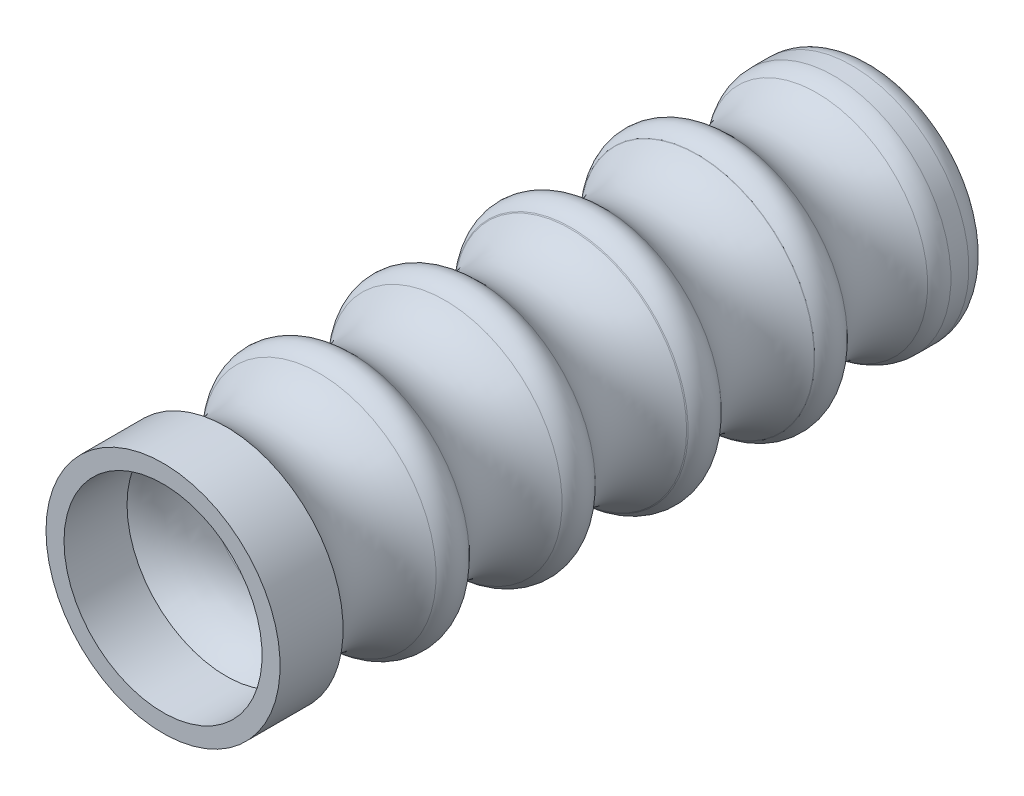
ISO-10303-21;
HEADER;
FILE_DESCRIPTION(('STEP AP214'),'2;1');
FILE_NAME('part.step','',(''),(''),'','','');
FILE_SCHEMA(('AUTOMOTIVE_DESIGN { 1 0 10303 214 1 1 1 1 }'));
ENDSEC;
DATA;
#1=APPLICATION_CONTEXT('core data for automotive mechanical design processes');
#2=APPLICATION_PROTOCOL_DEFINITION('international standard','automotive_design',2000,#1);
#3=PRODUCT_CONTEXT('',#1,'mechanical');
#4=PRODUCT('Part','Part','',(#3));
#5=PRODUCT_RELATED_PRODUCT_CATEGORY('part','',(#4));
#6=PRODUCT_DEFINITION_FORMATION('','',#4);
#7=PRODUCT_DEFINITION_CONTEXT('part definition',#1,'design');
#8=PRODUCT_DEFINITION('design','',#6,#7);
#9=PRODUCT_DEFINITION_SHAPE('','',#8);
#10=(LENGTH_UNIT() NAMED_UNIT(*) SI_UNIT(.MILLI.,.METRE.));
#11=(NAMED_UNIT(*) PLANE_ANGLE_UNIT() SI_UNIT($,.RADIAN.));
#12=(NAMED_UNIT(*) SI_UNIT($,.STERADIAN.) SOLID_ANGLE_UNIT());
#13=UNCERTAINTY_MEASURE_WITH_UNIT(LENGTH_MEASURE(1.E-05),#10,'distance_accuracy_value','');
#14=(GEOMETRIC_REPRESENTATION_CONTEXT(3) GLOBAL_UNCERTAINTY_ASSIGNED_CONTEXT((#13)) GLOBAL_UNIT_ASSIGNED_CONTEXT((#10,
#11,#12)) REPRESENTATION_CONTEXT('',''));
#15=CARTESIAN_POINT('',(0.,0.,0.));
#16=DIRECTION('',(0.,0.,1.));
#17=DIRECTION('',(1.,0.,0.));
#18=AXIS2_PLACEMENT_3D('',#15,#16,#17);
#19=CARTESIAN_POINT('',(-4.44387737948111,0.,-64.3386919312712));
#20=DIRECTION('',(0.,0.,-1.));
#21=DIRECTION('',(-1.,0.,0.));
#22=AXIS2_PLACEMENT_3D('',#19,#20,#21);
#23=TOROIDAL_SURFACE('',#22,10.5000023446732,2.5);
#24=CARTESIAN_POINT('',(-4.44387737948111,0.,-66.8386919312712));
#25=DIRECTION('',(0.,0.,-1.));
#26=DIRECTION('',(-1.,0.,0.));
#27=AXIS2_PLACEMENT_3D('',#24,#25,#26);
#28=CIRCLE('',#27,10.5000023446732);
#29=CARTESIAN_POINT('',(-14.9438797241543,0.,-66.8386919312712));
#30=VERTEX_POINT('',#29);
#31=EDGE_CURVE('E10',#30,#30,#28,.T.);
#32=ORIENTED_EDGE('',*,*,#31,.F.);
#33=EDGE_LOOP('',(#32));
#34=FACE_BOUND('',#33,.T.);
#35=CARTESIAN_POINT('',(-4.44387737948111,0.,-64.3386919312712));
#36=DIRECTION('',(0.,0.,-1.));
#37=DIRECTION('',(-1.,0.,0.));
#38=AXIS2_PLACEMENT_3D('',#35,#36,#37);
#39=CIRCLE('',#38,13.0000023446732);
#40=CARTESIAN_POINT('',(-17.4438797241543,0.,-64.3386919312712));
#41=VERTEX_POINT('',#40);
#42=EDGE_CURVE('E94',#41,#41,#39,.T.);
#43=ORIENTED_EDGE('',*,*,#42,.T.);
#44=EDGE_LOOP('',(#43));
#45=FACE_BOUND('',#44,.T.);
#46=ADVANCED_FACE('F30',(#34,#45),#23,.T.);
#47=CARTESIAN_POINT('',(6.05612496519209,0.,-66.8386919312712));
#48=DIRECTION('',(0.,0.,1.));
#49=DIRECTION('',(1.,0.,0.));
#50=AXIS2_PLACEMENT_3D('',#47,#48,#49);
#51=PLANE('',#50);
#52=CARTESIAN_POINT('',(-4.44387737948111,0.,-66.8386919312712));
#53=DIRECTION('',(0.,0.,-1.));
#54=DIRECTION('',(-1.,0.,0.));
#55=AXIS2_PLACEMENT_3D('',#52,#53,#54);
#56=CIRCLE('',#55,9.06762904577595);
#57=CARTESIAN_POINT('',(-13.5115064252571,0.,-66.8386919312712));
#58=VERTEX_POINT('',#57);
#59=EDGE_CURVE('E36',#58,#58,#56,.T.);
#60=ORIENTED_EDGE('',*,*,#59,.F.);
#61=EDGE_LOOP('',(#60));
#62=FACE_BOUND('',#61,.T.);
#63=ORIENTED_EDGE('',*,*,#31,.T.);
#64=EDGE_LOOP('',(#63));
#65=FACE_BOUND('',#64,.T.);
#66=ADVANCED_FACE('F113',(#62,#65),#51,.F.);
#67=CARTESIAN_POINT('',(-4.44387737948111,0.,-38.83686860797));
#68=DIRECTION('',(0.,0.,-1.));
#69=DIRECTION('',(-1.,0.,0.));
#70=AXIS2_PLACEMENT_3D('',#67,#68,#69);
#71=CYLINDRICAL_SURFACE('',#70,9.06762904577594);
#72=ORIENTED_EDGE('',*,*,#59,.T.);
#73=EDGE_LOOP('',(#72));
#74=FACE_BOUND('',#73,.T.);
#75=CARTESIAN_POINT('',(-4.4438773794811,0.,-1.83869193127119));
#76=DIRECTION('',(0.,0.,-1.));
#77=DIRECTION('',(-1.,0.,0.));
#78=AXIS2_PLACEMENT_3D('',#75,#76,#77);
#79=CIRCLE('',#78,9.06762904577594);
#80=CARTESIAN_POINT('',(-13.511506425257,0.,-1.83869193127119));
#81=VERTEX_POINT('',#80);
#82=EDGE_CURVE('E40',#81,#81,#79,.T.);
#83=ORIENTED_EDGE('',*,*,#82,.F.);
#84=EDGE_LOOP('',(#83));
#85=FACE_BOUND('',#84,.T.);
#86=ADVANCED_FACE('F109',(#74,#85),#71,.F.);
#87=CARTESIAN_POINT('',(6.5561226205189,0.,5.16130806872881));
#88=CARTESIAN_POINT('',(3.76001048112798,0.,2.13786769770095));
#89=CARTESIAN_POINT('',(4.62375166629483,0.,-1.83869193127119));
#90=B_SPLINE_CURVE_WITH_KNOTS('',2,(#87,#88,#89),.UNSPECIFIED.,.F.,.F.,(3,3),(0.,1.),.UNSPECIFIED.);
#91=CARTESIAN_POINT('',(-4.44387737948111,0.,-38.83686860797));
#92=DIRECTION('',(0.,0.,-1.));
#93=AXIS1_PLACEMENT('',#91,#92);
#94=SURFACE_OF_REVOLUTION('',#90,#93);
#95=ORIENTED_EDGE('',*,*,#82,.T.);
#96=EDGE_LOOP('',(#95));
#97=FACE_BOUND('',#96,.T.);
#98=CARTESIAN_POINT('',(-4.4438773794811,0.,5.1613080687288));
#99=DIRECTION('',(0.,0.,-1.));
#100=DIRECTION('',(-1.,0.,0.));
#101=AXIS2_PLACEMENT_3D('',#98,#99,#100);
#102=CIRCLE('',#101,11.);
#103=CARTESIAN_POINT('',(-15.4438773794811,0.,5.1613080687288));
#104=VERTEX_POINT('',#103);
#105=EDGE_CURVE('E44',#104,#104,#102,.T.);
#106=ORIENTED_EDGE('',*,*,#105,.F.);
#107=EDGE_LOOP('',(#106));
#108=FACE_BOUND('',#107,.T.);
#109=ADVANCED_FACE('F104',(#97,#108),#94,.F.);
#110=CARTESIAN_POINT('',(-4.44387737948111,0.,-38.83686860797));
#111=DIRECTION('',(0.,0.,-1.));
#112=DIRECTION('',(-1.,0.,0.));
#113=AXIS2_PLACEMENT_3D('',#110,#111,#112);
#114=CYLINDRICAL_SURFACE('',#113,11.);
#115=ORIENTED_EDGE('',*,*,#105,.T.);
#116=EDGE_LOOP('',(#115));
#117=FACE_BOUND('',#116,.T.);
#118=CARTESIAN_POINT('',(-4.4438773794811,0.,12.1613080687288));
#119=DIRECTION('',(0.,0.,-1.));
#120=DIRECTION('',(-1.,0.,0.));
#121=AXIS2_PLACEMENT_3D('',#118,#119,#120);
#122=CIRCLE('',#121,11.);
#123=CARTESIAN_POINT('',(-15.4438773794811,0.,12.1613080687288));
#124=VERTEX_POINT('',#123);
#125=EDGE_CURVE('E49',#124,#124,#122,.T.);
#126=ORIENTED_EDGE('',*,*,#125,.F.);
#127=EDGE_LOOP('',(#126));
#128=FACE_BOUND('',#127,.T.);
#129=ADVANCED_FACE('F108',(#117,#128),#114,.F.);
#130=CARTESIAN_POINT('',(8.5561226205189,0.,12.1613080687288));
#131=DIRECTION('',(0.,0.,1.));
#132=DIRECTION('',(1.,0.,0.));
#133=AXIS2_PLACEMENT_3D('',#130,#131,#132);
#134=PLANE('',#133);
#135=ORIENTED_EDGE('',*,*,#125,.T.);
#136=EDGE_LOOP('',(#135));
#137=FACE_BOUND('',#136,.T.);
#138=CARTESIAN_POINT('',(-4.4438773794811,0.,12.1613080687288));
#139=DIRECTION('',(0.,0.,-1.));
#140=DIRECTION('',(-1.,0.,0.));
#141=AXIS2_PLACEMENT_3D('',#138,#139,#140);
#142=CIRCLE('',#141,13.);
#143=CARTESIAN_POINT('',(-17.4438773794811,0.,12.1613080687288));
#144=VERTEX_POINT('',#143);
#145=EDGE_CURVE('E52',#144,#144,#142,.T.);
#146=ORIENTED_EDGE('',*,*,#145,.F.);
#147=EDGE_LOOP('',(#146));
#148=FACE_BOUND('',#147,.T.);
#149=ADVANCED_FACE('F182',(#137,#148),#134,.T.);
#150=CARTESIAN_POINT('',(-4.44387737948111,0.,-38.83686860797));
#151=DIRECTION('',(0.,0.,-1.));
#152=DIRECTION('',(-1.,0.,0.));
#153=AXIS2_PLACEMENT_3D('',#150,#151,#152);
#154=CYLINDRICAL_SURFACE('',#153,13.);
#155=ORIENTED_EDGE('',*,*,#145,.T.);
#156=EDGE_LOOP('',(#155));
#157=FACE_BOUND('',#156,.T.);
#158=CARTESIAN_POINT('',(-4.4438773794811,0.,5.1613080687288));
#159=DIRECTION('',(0.,0.,-1.));
#160=DIRECTION('',(-1.,0.,0.));
#161=AXIS2_PLACEMENT_3D('',#158,#159,#160);
#162=CIRCLE('',#161,13.);
#163=CARTESIAN_POINT('',(-17.4438773794811,0.,5.16130806872881));
#164=VERTEX_POINT('',#163);
#165=EDGE_CURVE('E55',#164,#164,#162,.T.);
#166=ORIENTED_EDGE('',*,*,#165,.F.);
#167=EDGE_LOOP('',(#166));
#168=FACE_BOUND('',#167,.T.);
#169=ADVANCED_FACE('F179',(#157,#168),#154,.T.);
#170=CARTESIAN_POINT('',(-4.4438773794811,0.,0.));
#171=DIRECTION('',(0.,0.,-1.));
#172=DIRECTION('',(-1.,0.,0.));
#173=AXIS2_PLACEMENT_3D('',#170,#171,#172);
#174=TOROIDAL_SURFACE('',#173,17.7287312272556,6.99999999999621);
#175=ORIENTED_EDGE('',*,*,#165,.T.);
#176=EDGE_LOOP('',(#175));
#177=FACE_BOUND('',#176,.T.);
#178=CARTESIAN_POINT('',(-4.4438773794811,0.,-5.1613080687288));
#179=DIRECTION('',(0.,0.,-1.));
#180=DIRECTION('',(-1.,0.,0.));
#181=AXIS2_PLACEMENT_3D('',#178,#179,#180);
#182=CIRCLE('',#181,13.);
#183=CARTESIAN_POINT('',(-17.4438773794811,0.,-5.1613080687288));
#184=VERTEX_POINT('',#183);
#185=EDGE_CURVE('E58',#184,#184,#182,.T.);
#186=ORIENTED_EDGE('',*,*,#185,.F.);
#187=EDGE_LOOP('',(#186));
#188=FACE_BOUND('',#187,.T.);
#189=ADVANCED_FACE('F175',(#177,#188),#174,.F.);
#190=CARTESIAN_POINT('',(-4.44387737948111,0.,-7.00463237899009));
#191=DIRECTION('',(0.,0.,-1.));
#192=DIRECTION('',(-1.,0.,0.));
#193=AXIS2_PLACEMENT_3D('',#190,#191,#192);
#194=TOROIDAL_SURFACE('',#193,11.3111674188364,2.5);
#195=CARTESIAN_POINT('',(-4.4438773794811,0.,-8.84551814143882));
#196=DIRECTION('',(0.,0.,-1.));
#197=DIRECTION('',(-1.,0.,0.));
#198=AXIS2_PLACEMENT_3D('',#195,#196,#197);
#199=CIRCLE('',#198,13.0026577704534);
#200=CARTESIAN_POINT('',(-17.4465351499346,0.,-8.84551814143881));
#201=VERTEX_POINT('',#200);
#202=EDGE_CURVE('E61',#201,#201,#199,.T.);
#203=ORIENTED_EDGE('',*,*,#202,.F.);
#204=EDGE_LOOP('',(#203));
#205=FACE_BOUND('',#204,.T.);
#206=ORIENTED_EDGE('',*,*,#185,.T.);
#207=EDGE_LOOP('',(#206));
#208=FACE_BOUND('',#207,.T.);
#209=ADVANCED_FACE('F171',(#205,#208),#194,.T.);
#210=CARTESIAN_POINT('',(-4.4438773794811,0.,-14.0000036464255));
#211=DIRECTION('',(0.,0.,-1.));
#212=DIRECTION('',(-1.,0.,0.));
#213=AXIS2_PLACEMENT_3D('',#210,#211,#212);
#214=TOROIDAL_SURFACE('',#213,17.7388356893034,7.00000729286192);
#215=ORIENTED_EDGE('',*,*,#202,.T.);
#216=EDGE_LOOP('',(#215));
#217=FACE_BOUND('',#216,.T.);
#218=CARTESIAN_POINT('',(-4.44387737948111,0.,-19.1544901126445));
#219=DIRECTION('',(0.,0.,-1.));
#220=DIRECTION('',(-1.,0.,0.));
#221=AXIS2_PLACEMENT_3D('',#218,#219,#220);
#222=CIRCLE('',#221,13.0026588165837);
#223=CARTESIAN_POINT('',(-17.4465361960648,0.,-19.1544901126445));
#224=VERTEX_POINT('',#223);
#225=EDGE_CURVE('E64',#224,#224,#222,.T.);
#226=ORIENTED_EDGE('',*,*,#225,.F.);
#227=EDGE_LOOP('',(#226));
#228=FACE_BOUND('',#227,.T.);
#229=ADVANCED_FACE('F167',(#217,#228),#214,.F.);
#230=CARTESIAN_POINT('',(-4.44387737948111,0.,-20.9953762183901));
#231=DIRECTION('',(0.,0.,-1.));
#232=DIRECTION('',(-1.,0.,0.));
#233=AXIS2_PLACEMENT_3D('',#230,#231,#232);
#234=TOROIDAL_SURFACE('',#233,11.3111688385842,2.5);
#235=CARTESIAN_POINT('',(-4.44387737948111,0.,-22.8386996812448));
#236=DIRECTION('',(0.,0.,-1.));
#237=DIRECTION('',(-1.,0.,0.));
#238=AXIS2_PLACEMENT_3D('',#235,#236,#237);
#239=CIRCLE('',#238,13.0000023446733);
#240=CARTESIAN_POINT('',(-17.4438797241544,0.,-22.8386996812448));
#241=VERTEX_POINT('',#240);
#242=EDGE_CURVE('E67',#241,#241,#239,.T.);
#243=ORIENTED_EDGE('',*,*,#242,.F.);
#244=EDGE_LOOP('',(#243));
#245=FACE_BOUND('',#244,.T.);
#246=ORIENTED_EDGE('',*,*,#225,.T.);
#247=EDGE_LOOP('',(#246));
#248=FACE_BOUND('',#247,.T.);
#249=ADVANCED_FACE('F163',(#245,#248),#234,.T.);
#250=CARTESIAN_POINT('',(-4.44387737948111,0.,-27.9999999999967));
#251=DIRECTION('',(0.,0.,-1.));
#252=DIRECTION('',(-1.,0.,0.));
#253=AXIS2_PLACEMENT_3D('',#250,#251,#252);
#254=TOROIDAL_SURFACE('',#253,17.7287312351509,6.99999270713808);
#255=ORIENTED_EDGE('',*,*,#242,.T.);
#256=EDGE_LOOP('',(#255));
#257=FACE_BOUND('',#256,.T.);
#258=CARTESIAN_POINT('',(-4.44387737948111,0.,-33.078995813976));
#259=DIRECTION('',(0.,0.,-1.));
#260=DIRECTION('',(-1.,0.,0.));
#261=AXIS2_PLACEMENT_3D('',#258,#259,#260);
#262=CIRCLE('',#261,12.9117093936428);
#263=CARTESIAN_POINT('',(-17.3555867731239,0.,-33.078995813976));
#264=VERTEX_POINT('',#263);
#265=EDGE_CURVE('E70',#264,#264,#262,.T.);
#266=ORIENTED_EDGE('',*,*,#265,.F.);
#267=EDGE_LOOP('',(#266));
#268=FACE_BOUND('',#267,.T.);
#269=ADVANCED_FACE('F159',(#257,#268),#254,.F.);
#270=CARTESIAN_POINT('',(-4.44387737948111,0.,-33.1544901126445));
#271=DIRECTION('',(0.,0.,-1.));
#272=DIRECTION('',(-1.,0.,0.));
#273=AXIS2_PLACEMENT_3D('',#270,#271,#272);
#274=CONICAL_SURFACE('',#273,13.0026588165836,0.877987624005164);
#275=ORIENTED_EDGE('',*,*,#265,.T.);
#276=EDGE_LOOP('',(#275));
#277=FACE_BOUND('',#276,.T.);
#278=CARTESIAN_POINT('',(-4.44387737948111,0.,-33.1544901126445));
#279=DIRECTION('',(0.,0.,-1.));
#280=DIRECTION('',(-1.,0.,0.));
#281=AXIS2_PLACEMENT_3D('',#278,#279,#280);
#282=CIRCLE('',#281,13.0026588165836);
#283=CARTESIAN_POINT('',(-17.4465361960647,0.,-33.1544901126445));
#284=VERTEX_POINT('',#283);
#285=EDGE_CURVE('E73',#284,#284,#282,.T.);
#286=ORIENTED_EDGE('',*,*,#285,.F.);
#287=EDGE_LOOP('',(#286));
#288=FACE_BOUND('',#287,.T.);
#289=ADVANCED_FACE('F155',(#277,#288),#274,.T.);
#290=CARTESIAN_POINT('',(-4.44387737948111,0.,-34.9953762183901));
#291=DIRECTION('',(0.,0.,-1.));
#292=DIRECTION('',(-1.,0.,0.));
#293=AXIS2_PLACEMENT_3D('',#290,#291,#292);
#294=TOROIDAL_SURFACE('',#293,11.3111688385841,2.5);
#295=CARTESIAN_POINT('',(-4.44387737948111,0.,-36.8386996812448));
#296=DIRECTION('',(0.,0.,-1.));
#297=DIRECTION('',(-1.,0.,0.));
#298=AXIS2_PLACEMENT_3D('',#295,#296,#297);
#299=CIRCLE('',#298,13.0000023446732);
#300=CARTESIAN_POINT('',(-17.4438797241543,0.,-36.8386996812448));
#301=VERTEX_POINT('',#300);
#302=EDGE_CURVE('E76',#301,#301,#299,.T.);
#303=ORIENTED_EDGE('',*,*,#302,.F.);
#304=EDGE_LOOP('',(#303));
#305=FACE_BOUND('',#304,.T.);
#306=ORIENTED_EDGE('',*,*,#285,.T.);
#307=EDGE_LOOP('',(#306));
#308=FACE_BOUND('',#307,.T.);
#309=ADVANCED_FACE('F151',(#305,#308),#294,.T.);
#310=CARTESIAN_POINT('',(-4.44387737948111,0.,-41.9999999999967));
#311=DIRECTION('',(0.,0.,-1.));
#312=DIRECTION('',(-1.,0.,0.));
#313=AXIS2_PLACEMENT_3D('',#310,#311,#312);
#314=TOROIDAL_SURFACE('',#313,17.7287312351509,6.99999270713808);
#315=ORIENTED_EDGE('',*,*,#302,.T.);
#316=EDGE_LOOP('',(#315));
#317=FACE_BOUND('',#316,.T.);
#318=CARTESIAN_POINT('',(-4.44387737948111,0.,-47.1613003187486));
#319=DIRECTION('',(0.,0.,-1.));
#320=DIRECTION('',(-1.,0.,0.));
#321=AXIS2_PLACEMENT_3D('',#318,#319,#320);
#322=CIRCLE('',#321,13.0000023446732);
#323=CARTESIAN_POINT('',(-17.4438797241543,0.,-47.1613003187486));
#324=VERTEX_POINT('',#323);
#325=EDGE_CURVE('E79',#324,#324,#322,.T.);
#326=ORIENTED_EDGE('',*,*,#325,.F.);
#327=EDGE_LOOP('',(#326));
#328=FACE_BOUND('',#327,.T.);
#329=ADVANCED_FACE('F147',(#317,#328),#314,.F.);
#330=CARTESIAN_POINT('',(-4.44387737948111,0.,-47.1613003187486));
#331=DIRECTION('',(0.,0.,-1.));
#332=DIRECTION('',(-1.,0.,0.));
#333=AXIS2_PLACEMENT_3D('',#330,#331,#332);
#334=CONICAL_SURFACE('',#333,13.0000023446732,0.998560911686196);
#335=CARTESIAN_POINT('',(-4.44387737948111,0.,-47.1819595420842));
#336=DIRECTION('',(0.,0.,-1.));
#337=DIRECTION('',(-1.,0.,0.));
#338=AXIS2_PLACEMENT_3D('',#335,#336,#337);
#339=CIRCLE('',#338,13.0320755641493);
#340=CARTESIAN_POINT('',(-17.4759529436304,0.,-47.1819595420842));
#341=VERTEX_POINT('',#340);
#342=EDGE_CURVE('E82',#341,#341,#339,.T.);
#343=ORIENTED_EDGE('',*,*,#342,.F.);
#344=EDGE_LOOP('',(#343));
#345=FACE_BOUND('',#344,.T.);
#346=ORIENTED_EDGE('',*,*,#325,.T.);
#347=EDGE_LOOP('',(#346));
#348=FACE_BOUND('',#347,.T.);
#349=ADVANCED_FACE('F143',(#345,#348),#334,.T.);
#350=CARTESIAN_POINT('',(-4.44387737948111,0.,-48.9953762183901));
#351=DIRECTION('',(0.,0.,-1.));
#352=DIRECTION('',(-1.,0.,0.));
#353=AXIS2_PLACEMENT_3D('',#350,#351,#352);
#354=TOROIDAL_SURFACE('',#353,11.3111688385841,2.5);
#355=CARTESIAN_POINT('',(-4.44387737948111,0.,-50.8386996812448));
#356=DIRECTION('',(0.,0.,-1.));
#357=DIRECTION('',(-1.,0.,0.));
#358=AXIS2_PLACEMENT_3D('',#355,#356,#357);
#359=CIRCLE('',#358,13.0000023446732);
#360=CARTESIAN_POINT('',(-17.4438797241543,0.,-50.8386996812448));
#361=VERTEX_POINT('',#360);
#362=EDGE_CURVE('E85',#361,#361,#359,.T.);
#363=ORIENTED_EDGE('',*,*,#362,.F.);
#364=EDGE_LOOP('',(#363));
#365=FACE_BOUND('',#364,.T.);
#366=ORIENTED_EDGE('',*,*,#342,.T.);
#367=EDGE_LOOP('',(#366));
#368=FACE_BOUND('',#367,.T.);
#369=ADVANCED_FACE('F139',(#365,#368),#354,.T.);
#370=CARTESIAN_POINT('',(-4.44387737948111,0.,-55.9999999999967));
#371=DIRECTION('',(0.,0.,-1.));
#372=DIRECTION('',(-1.,0.,0.));
#373=AXIS2_PLACEMENT_3D('',#370,#371,#372);
#374=TOROIDAL_SURFACE('',#373,17.7287312351508,6.99999270713808);
#375=ORIENTED_EDGE('',*,*,#362,.T.);
#376=EDGE_LOOP('',(#375));
#377=FACE_BOUND('',#376,.T.);
#378=CARTESIAN_POINT('',(-4.44387737948111,0.,-60.4419166547389));
#379=DIRECTION('',(0.,0.,-1.));
#380=DIRECTION('',(-1.,0.,0.));
#381=AXIS2_PLACEMENT_3D('',#378,#379,#380);
#382=CIRCLE('',#381,12.3186227027543);
#383=CARTESIAN_POINT('',(-16.7625000822354,0.,-60.4419166547389));
#384=VERTEX_POINT('',#383);
#385=EDGE_CURVE('E88',#384,#384,#382,.T.);
#386=ORIENTED_EDGE('',*,*,#385,.F.);
#387=EDGE_LOOP('',(#386));
#388=FACE_BOUND('',#387,.T.);
#389=ADVANCED_FACE('F133',(#377,#388),#374,.F.);
#390=CARTESIAN_POINT('',(-4.44387737948111,0.,-62.3455972043826));
#391=DIRECTION('',(0.,0.,-1.));
#392=DIRECTION('',(-1.,0.,0.));
#393=AXIS2_PLACEMENT_3D('',#390,#391,#392);
#394=TOROIDAL_SURFACE('',#393,10.0000023446732,3.);
#395=CARTESIAN_POINT('',(-4.44387737948111,0.,-62.3455972043826));
#396=DIRECTION('',(0.,0.,-1.));
#397=DIRECTION('',(-1.,0.,0.));
#398=AXIS2_PLACEMENT_3D('',#395,#396,#397);
#399=CIRCLE('',#398,13.0000023446732);
#400=CARTESIAN_POINT('',(-17.4438797241543,0.,-62.3455972043826));
#401=VERTEX_POINT('',#400);
#402=EDGE_CURVE('E91',#401,#401,#399,.T.);
#403=ORIENTED_EDGE('',*,*,#402,.F.);
#404=EDGE_LOOP('',(#403));
#405=FACE_BOUND('',#404,.T.);
#406=ORIENTED_EDGE('',*,*,#385,.T.);
#407=EDGE_LOOP('',(#406));
#408=FACE_BOUND('',#407,.T.);
#409=ADVANCED_FACE('F127',(#405,#408),#394,.T.);
#410=CARTESIAN_POINT('',(-4.44387737948111,0.,-38.83686860797));
#411=DIRECTION('',(0.,0.,-1.));
#412=DIRECTION('',(-1.,0.,0.));
#413=AXIS2_PLACEMENT_3D('',#410,#411,#412);
#414=CYLINDRICAL_SURFACE('',#413,13.0000023446732);
#415=ORIENTED_EDGE('',*,*,#402,.T.);
#416=EDGE_LOOP('',(#415));
#417=FACE_BOUND('',#416,.T.);
#418=ORIENTED_EDGE('',*,*,#42,.F.);
#419=EDGE_LOOP('',(#418));
#420=FACE_BOUND('',#419,.T.);
#421=ADVANCED_FACE('F125',(#417,#420),#414,.T.);
#422=CLOSED_SHELL('',(#46,#66,#86,#109,#129,#149,#169,#189,#209,#229,#249,#269,#289,#309,#329,
#349,#369,#389,#409,#421));
#423=MANIFOLD_SOLID_BREP('B2',#422);
#424=ADVANCED_BREP_SHAPE_REPRESENTATION('',(#18,#423),#14);
#425=SHAPE_DEFINITION_REPRESENTATION(#9,#424);
ENDSEC;
END-ISO-10303-21;
